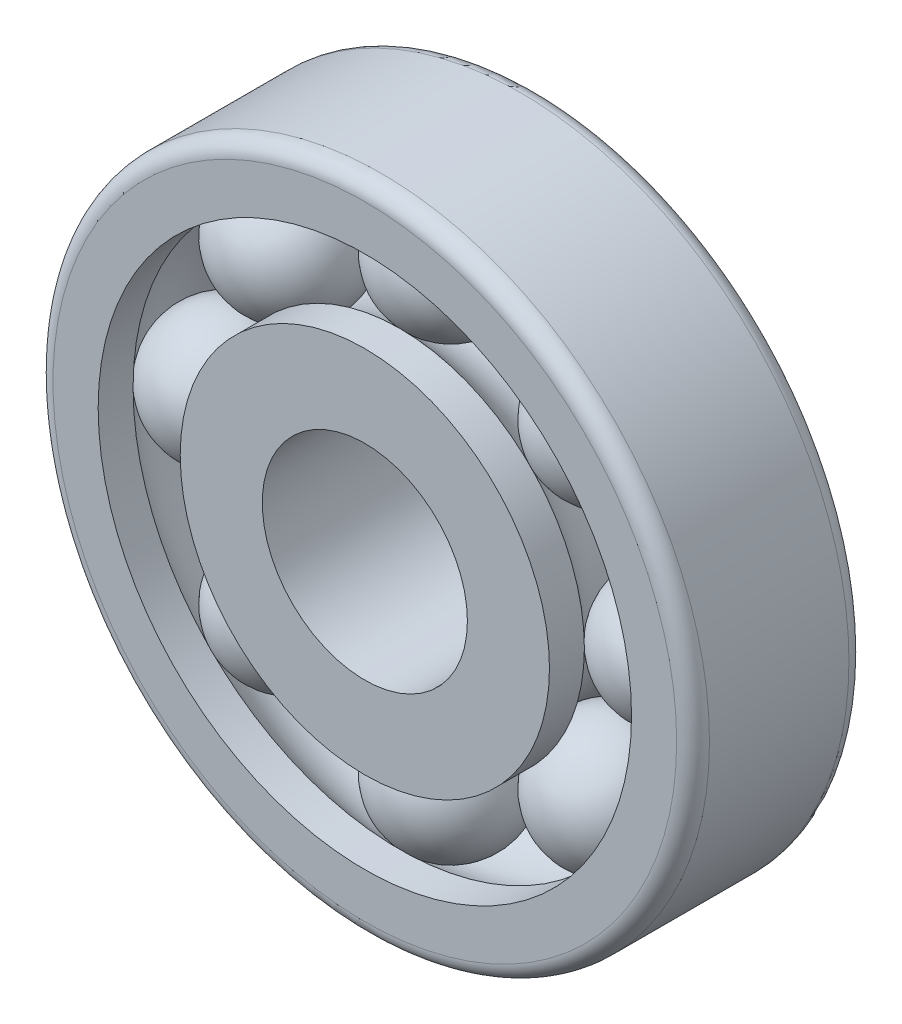
ISO-10303-21;
HEADER;
FILE_DESCRIPTION(('STEP AP214'),'2;1');
FILE_NAME('part.step','',(''),(''),'','','');
FILE_SCHEMA(('AUTOMOTIVE_DESIGN { 1 0 10303 214 1 1 1 1 }'));
ENDSEC;
DATA;
#1=APPLICATION_CONTEXT('core data for automotive mechanical design processes');
#2=APPLICATION_PROTOCOL_DEFINITION('international standard','automotive_design',2000,#1);
#3=PRODUCT_CONTEXT('',#1,'mechanical');
#4=PRODUCT('Part','Part','',(#3));
#5=PRODUCT_RELATED_PRODUCT_CATEGORY('part','',(#4));
#6=PRODUCT_DEFINITION_FORMATION('','',#4);
#7=PRODUCT_DEFINITION_CONTEXT('part definition',#1,'design');
#8=PRODUCT_DEFINITION('design','',#6,#7);
#9=PRODUCT_DEFINITION_SHAPE('','',#8);
#10=(LENGTH_UNIT() NAMED_UNIT(*) SI_UNIT(.MILLI.,.METRE.));
#11=(NAMED_UNIT(*) PLANE_ANGLE_UNIT() SI_UNIT($,.RADIAN.));
#12=(NAMED_UNIT(*) SI_UNIT($,.STERADIAN.) SOLID_ANGLE_UNIT());
#13=UNCERTAINTY_MEASURE_WITH_UNIT(LENGTH_MEASURE(1.E-05),#10,'distance_accuracy_value','');
#14=(GEOMETRIC_REPRESENTATION_CONTEXT(3) GLOBAL_UNCERTAINTY_ASSIGNED_CONTEXT((#13)) GLOBAL_UNIT_ASSIGNED_CONTEXT((#10,
#11,#12)) REPRESENTATION_CONTEXT('',''));
#15=CARTESIAN_POINT('',(0.,0.,0.));
#16=DIRECTION('',(0.,0.,1.));
#17=DIRECTION('',(1.,0.,0.));
#18=AXIS2_PLACEMENT_3D('',#15,#16,#17);
#19=CARTESIAN_POINT('',(19.4454364826303,-19.4454364826298,10.5));
#20=DIRECTION('',(0.,0.,-1.));
#21=DIRECTION('',(0.707106781186556,-0.707106781186539,0.));
#22=AXIS2_PLACEMENT_3D('',#19,#20,#21);
#23=SPHERICAL_SURFACE('',#22,8.);
#24=CARTESIAN_POINT('',(19.4454364826303,-19.4454364826298,2.50000000000001));
#25=VERTEX_POINT('',#24);
#26=VERTEX_LOOP('',#25);
#27=FACE_BOUND('',#26,.T.);
#28=ADVANCED_FACE('F52',(#27),#23,.T.);
#29=CLOSED_SHELL('',(#28));
#30=MANIFOLD_SOLID_BREP('B2',#29);
#31=CARTESIAN_POINT('',(2.88047210454559E-13,-27.5,10.5));
#32=DIRECTION('',(0.,0.,-1.));
#33=DIRECTION('',(0.,-1.,0.));
#34=AXIS2_PLACEMENT_3D('',#31,#32,#33);
#35=SPHERICAL_SURFACE('',#34,8.);
#36=CARTESIAN_POINT('',(2.88047210454559E-13,-27.5,2.50000000000001));
#37=VERTEX_POINT('',#36);
#38=VERTEX_LOOP('',#37);
#39=FACE_BOUND('',#38,.T.);
#40=ADVANCED_FACE('F73',(#39),#35,.T.);
#41=CLOSED_SHELL('',(#40));
#42=MANIFOLD_SOLID_BREP('B7',#41);
#43=CARTESIAN_POINT('',(-19.4454364826299,-19.4454364826302,10.5));
#44=DIRECTION('',(0.,0.,-1.));
#45=DIRECTION('',(-0.707106781186541,-0.707106781186554,0.));
#46=AXIS2_PLACEMENT_3D('',#43,#44,#45);
#47=SPHERICAL_SURFACE('',#46,8.);
#48=CARTESIAN_POINT('',(-19.4454364826299,-19.4454364826302,2.50000000000001));
#49=VERTEX_POINT('',#48);
#50=VERTEX_LOOP('',#49);
#51=FACE_BOUND('',#50,.T.);
#52=ADVANCED_FACE('F94',(#51),#47,.T.);
#53=CLOSED_SHELL('',(#52));
#54=MANIFOLD_SOLID_BREP('B48',#53);
#55=CARTESIAN_POINT('',(-27.5,0.,10.5));
#56=DIRECTION('',(0.,0.,-1.));
#57=DIRECTION('',(-1.,0.,0.));
#58=AXIS2_PLACEMENT_3D('',#55,#56,#57);
#59=SPHERICAL_SURFACE('',#58,8.);
#60=CARTESIAN_POINT('',(-27.5,0.,2.50000000000001));
#61=VERTEX_POINT('',#60);
#62=VERTEX_LOOP('',#61);
#63=FACE_BOUND('',#62,.T.);
#64=ADVANCED_FACE('F115',(#63),#59,.T.);
#65=CLOSED_SHELL('',(#64));
#66=MANIFOLD_SOLID_BREP('B69',#65);
#67=CARTESIAN_POINT('',(-19.4454364826302,19.44543648263,10.5));
#68=DIRECTION('',(0.,0.,-1.));
#69=DIRECTION('',(-0.707106781186551,0.707106781186544,0.));
#70=AXIS2_PLACEMENT_3D('',#67,#68,#69);
#71=SPHERICAL_SURFACE('',#70,8.);
#72=CARTESIAN_POINT('',(-19.4454364826302,19.44543648263,2.50000000000001));
#73=VERTEX_POINT('',#72);
#74=VERTEX_LOOP('',#73);
#75=FACE_BOUND('',#74,.T.);
#76=ADVANCED_FACE('F136',(#75),#71,.T.);
#77=CLOSED_SHELL('',(#76));
#78=MANIFOLD_SOLID_BREP('B90',#77);
#79=CARTESIAN_POINT('',(0.,27.5,10.5));
#80=DIRECTION('',(0.,0.,-1.));
#81=DIRECTION('',(0.,1.,0.));
#82=AXIS2_PLACEMENT_3D('',#79,#80,#81);
#83=SPHERICAL_SURFACE('',#82,8.);
#84=CARTESIAN_POINT('',(0.,27.5,2.50000000000001));
#85=VERTEX_POINT('',#84);
#86=VERTEX_LOOP('',#85);
#87=FACE_BOUND('',#86,.T.);
#88=ADVANCED_FACE('F157',(#87),#83,.T.);
#89=CLOSED_SHELL('',(#88));
#90=MANIFOLD_SOLID_BREP('B111',#89);
#91=CARTESIAN_POINT('',(19.44543648263,19.4454364826301,10.5));
#92=DIRECTION('',(0.,0.,-1.));
#93=DIRECTION('',(0.707106781186546,0.707106781186549,0.));
#94=AXIS2_PLACEMENT_3D('',#91,#92,#93);
#95=SPHERICAL_SURFACE('',#94,8.);
#96=CARTESIAN_POINT('',(19.44543648263,19.4454364826301,2.50000000000001));
#97=VERTEX_POINT('',#96);
#98=VERTEX_LOOP('',#97);
#99=FACE_BOUND('',#98,.T.);
#100=ADVANCED_FACE('F178',(#99),#95,.T.);
#101=CLOSED_SHELL('',(#100));
#102=MANIFOLD_SOLID_BREP('B132',#101);
#103=CARTESIAN_POINT('',(27.5,0.,10.5));
#104=DIRECTION('',(0.,0.,-1.));
#105=DIRECTION('',(1.,0.,0.));
#106=AXIS2_PLACEMENT_3D('',#103,#104,#105);
#107=SPHERICAL_SURFACE('',#106,8.);
#108=CARTESIAN_POINT('',(27.5,0.,2.50000000000001));
#109=VERTEX_POINT('',#108);
#110=VERTEX_LOOP('',#109);
#111=FACE_BOUND('',#110,.T.);
#112=ADVANCED_FACE('F201',(#111),#107,.T.);
#113=CLOSED_SHELL('',(#112));
#114=MANIFOLD_SOLID_BREP('B153',#113);
#115=CARTESIAN_POINT('',(0.,0.,21.));
#116=DIRECTION('',(0.,0.,-1.));
#117=DIRECTION('',(-1.,0.,0.));
#118=AXIS2_PLACEMENT_3D('',#115,#116,#117);
#119=CYLINDRICAL_SURFACE('',#118,22.5);
#120=CARTESIAN_POINT('',(0.,0.,16.7449979983984));
#121=DIRECTION('',(0.,0.,-1.));
#122=DIRECTION('',(-1.,0.,0.));
#123=AXIS2_PLACEMENT_3D('',#120,#121,#122);
#124=CIRCLE('',#123,22.5);
#125=CARTESIAN_POINT('',(-22.5,0.,16.7449979983984));
#126=VERTEX_POINT('',#125);
#127=EDGE_CURVE('E227',#126,#126,#124,.F.);
#128=ORIENTED_EDGE('',*,*,#127,.T.);
#129=EDGE_LOOP('',(#128));
#130=FACE_BOUND('',#129,.T.);
#131=CARTESIAN_POINT('',(0.,0.,21.));
#132=DIRECTION('',(0.,0.,1.));
#133=DIRECTION('',(1.,0.,0.));
#134=AXIS2_PLACEMENT_3D('',#131,#132,#133);
#135=CIRCLE('',#134,22.5);
#136=CARTESIAN_POINT('',(22.5,0.,21.));
#137=VERTEX_POINT('',#136);
#138=EDGE_CURVE('E200',#137,#137,#135,.T.);
#139=ORIENTED_EDGE('',*,*,#138,.F.);
#140=EDGE_LOOP('',(#139));
#141=FACE_BOUND('',#140,.T.);
#142=ADVANCED_FACE('F223',(#130,#141),#119,.T.);
#143=CARTESIAN_POINT('',(0.,0.,21.));
#144=DIRECTION('',(0.,0.,-1.));
#145=DIRECTION('',(-1.,0.,0.));
#146=AXIS2_PLACEMENT_3D('',#143,#144,#145);
#147=CYLINDRICAL_SURFACE('',#146,12.5);
#148=CARTESIAN_POINT('',(0.,0.,21.));
#149=DIRECTION('',(0.,0.,1.));
#150=DIRECTION('',(1.,0.,0.));
#151=AXIS2_PLACEMENT_3D('',#148,#149,#150);
#152=CIRCLE('',#151,12.5);
#153=CARTESIAN_POINT('',(12.5,0.,21.));
#154=VERTEX_POINT('',#153);
#155=EDGE_CURVE('E231',#154,#154,#152,.T.);
#156=ORIENTED_EDGE('',*,*,#155,.T.);
#157=EDGE_LOOP('',(#156));
#158=FACE_BOUND('',#157,.T.);
#159=CARTESIAN_POINT('',(0.,0.,0.));
#160=DIRECTION('',(0.,0.,1.));
#161=DIRECTION('',(1.,0.,0.));
#162=AXIS2_PLACEMENT_3D('',#159,#160,#161);
#163=CIRCLE('',#162,12.5);
#164=CARTESIAN_POINT('',(12.5,0.,0.));
#165=VERTEX_POINT('',#164);
#166=EDGE_CURVE('E239',#165,#165,#163,.T.);
#167=ORIENTED_EDGE('',*,*,#166,.F.);
#168=EDGE_LOOP('',(#167));
#169=FACE_BOUND('',#168,.T.);
#170=ADVANCED_FACE('F225',(#158,#169),#147,.F.);
#171=CARTESIAN_POINT('',(0.,0.,4.25500200160161));
#172=DIRECTION('',(0.,0.,1.));
#173=DIRECTION('',(1.,0.,0.));
#174=AXIS2_PLACEMENT_3D('',#171,#172,#173);
#175=CIRCLE('',#174,22.5);
#176=CARTESIAN_POINT('',(22.5,0.,4.25500200160161));
#177=VERTEX_POINT('',#176);
#178=EDGE_CURVE('E243',#177,#177,#175,.F.);
#179=ORIENTED_EDGE('',*,*,#178,.T.);
#180=EDGE_LOOP('',(#179));
#181=FACE_BOUND('',#180,.T.);
#182=CARTESIAN_POINT('',(0.,0.,0.));
#183=DIRECTION('',(0.,0.,1.));
#184=DIRECTION('',(1.,0.,0.));
#185=AXIS2_PLACEMENT_3D('',#182,#183,#184);
#186=CIRCLE('',#185,22.5);
#187=CARTESIAN_POINT('',(22.5,0.,0.));
#188=VERTEX_POINT('',#187);
#189=EDGE_CURVE('E236',#188,#188,#186,.T.);
#190=ORIENTED_EDGE('',*,*,#189,.T.);
#191=EDGE_LOOP('',(#190));
#192=FACE_BOUND('',#191,.T.);
#193=ADVANCED_FACE('F265',(#181,#192),#119,.T.);
#194=CARTESIAN_POINT('',(0.,0.,21.));
#195=DIRECTION('',(0.,0.,1.));
#196=DIRECTION('',(1.,0.,0.));
#197=AXIS2_PLACEMENT_3D('',#194,#195,#196);
#198=PLANE('',#197);
#199=ORIENTED_EDGE('',*,*,#155,.F.);
#200=EDGE_LOOP('',(#199));
#201=FACE_BOUND('',#200,.T.);
#202=ORIENTED_EDGE('',*,*,#138,.T.);
#203=EDGE_LOOP('',(#202));
#204=FACE_BOUND('',#203,.T.);
#205=ADVANCED_FACE('F260',(#201,#204),#198,.T.);
#206=CARTESIAN_POINT('',(0.,0.,0.));
#207=DIRECTION('',(0.,0.,1.));
#208=DIRECTION('',(1.,0.,0.));
#209=AXIS2_PLACEMENT_3D('',#206,#207,#208);
#210=PLANE('',#209);
#211=ORIENTED_EDGE('',*,*,#166,.T.);
#212=EDGE_LOOP('',(#211));
#213=FACE_BOUND('',#212,.T.);
#214=ORIENTED_EDGE('',*,*,#189,.F.);
#215=EDGE_LOOP('',(#214));
#216=FACE_BOUND('',#215,.T.);
#217=ADVANCED_FACE('F254',(#213,#216),#210,.F.);
#218=CARTESIAN_POINT('',(0.,0.,10.5));
#219=DIRECTION('',(0.,0.,1.));
#220=DIRECTION('',(1.,0.,0.));
#221=AXIS2_PLACEMENT_3D('',#218,#219,#220);
#222=TOROIDAL_SURFACE('',#221,27.5,8.);
#223=ORIENTED_EDGE('',*,*,#178,.F.);
#224=EDGE_LOOP('',(#223));
#225=FACE_BOUND('',#224,.T.);
#226=ORIENTED_EDGE('',*,*,#127,.F.);
#227=EDGE_LOOP('',(#226));
#228=FACE_BOUND('',#227,.T.);
#229=ADVANCED_FACE('F252',(#225,#228),#222,.F.);
#230=CLOSED_SHELL('',(#142,#170,#193,#205,#217,#229));
#231=MANIFOLD_SOLID_BREP('B174',#230);
#232=CARTESIAN_POINT('',(0.,0.,21.));
#233=DIRECTION('',(0.,0.,-1.));
#234=DIRECTION('',(-1.,0.,0.));
#235=AXIS2_PLACEMENT_3D('',#232,#233,#234);
#236=CYLINDRICAL_SURFACE('',#235,32.5);
#237=CARTESIAN_POINT('',(0.,0.,16.7449979983984));
#238=DIRECTION('',(0.,0.,-1.));
#239=DIRECTION('',(-1.,0.,0.));
#240=AXIS2_PLACEMENT_3D('',#237,#238,#239);
#241=CIRCLE('',#240,32.5);
#242=CARTESIAN_POINT('',(-32.5,0.,16.7449979983984));
#243=VERTEX_POINT('',#242);
#244=EDGE_CURVE('E345',#243,#243,#241,.F.);
#245=ORIENTED_EDGE('',*,*,#244,.F.);
#246=EDGE_LOOP('',(#245));
#247=FACE_BOUND('',#246,.T.);
#248=CARTESIAN_POINT('',(0.,0.,21.));
#249=DIRECTION('',(0.,0.,1.));
#250=DIRECTION('',(1.,0.,0.));
#251=AXIS2_PLACEMENT_3D('',#248,#249,#250);
#252=CIRCLE('',#251,32.5);
#253=CARTESIAN_POINT('',(32.5,0.,21.));
#254=VERTEX_POINT('',#253);
#255=EDGE_CURVE('E344',#254,#254,#252,.T.);
#256=ORIENTED_EDGE('',*,*,#255,.T.);
#257=EDGE_LOOP('',(#256));
#258=FACE_BOUND('',#257,.T.);
#259=ADVANCED_FACE('F320',(#247,#258),#236,.F.);
#260=CARTESIAN_POINT('',(0.,0.,4.25500200160161));
#261=DIRECTION('',(0.,0.,1.));
#262=DIRECTION('',(1.,0.,0.));
#263=AXIS2_PLACEMENT_3D('',#260,#261,#262);
#264=CIRCLE('',#263,32.5);
#265=CARTESIAN_POINT('',(32.5,0.,4.25500200160161));
#266=VERTEX_POINT('',#265);
#267=EDGE_CURVE('E350',#266,#266,#264,.F.);
#268=ORIENTED_EDGE('',*,*,#267,.F.);
#269=EDGE_LOOP('',(#268));
#270=FACE_BOUND('',#269,.T.);
#271=CARTESIAN_POINT('',(0.,0.,0.));
#272=DIRECTION('',(0.,0.,1.));
#273=DIRECTION('',(1.,0.,0.));
#274=AXIS2_PLACEMENT_3D('',#271,#272,#273);
#275=CIRCLE('',#274,32.5);
#276=CARTESIAN_POINT('',(32.5,0.,0.));
#277=VERTEX_POINT('',#276);
#278=EDGE_CURVE('E349',#277,#277,#275,.T.);
#279=ORIENTED_EDGE('',*,*,#278,.F.);
#280=EDGE_LOOP('',(#279));
#281=FACE_BOUND('',#280,.T.);
#282=ADVANCED_FACE('F374',(#270,#281),#236,.F.);
#283=CARTESIAN_POINT('',(0.,0.,21.));
#284=DIRECTION('',(0.,0.,-1.));
#285=DIRECTION('',(-1.,0.,0.));
#286=AXIS2_PLACEMENT_3D('',#283,#284,#285);
#287=CYLINDRICAL_SURFACE('',#286,40.);
#288=CARTESIAN_POINT('',(0.,0.,19.));
#289=DIRECTION('',(0.,0.,1.));
#290=DIRECTION('',(1.,0.,0.));
#291=AXIS2_PLACEMENT_3D('',#288,#289,#290);
#292=CIRCLE('',#291,40.);
#293=CARTESIAN_POINT('',(40.,0.,19.));
#294=VERTEX_POINT('',#293);
#295=EDGE_CURVE('E328',#294,#294,#292,.F.);
#296=ORIENTED_EDGE('',*,*,#295,.T.);
#297=EDGE_LOOP('',(#296));
#298=FACE_BOUND('',#297,.T.);
#299=CARTESIAN_POINT('',(0.,0.,2.));
#300=DIRECTION('',(0.,0.,1.));
#301=DIRECTION('',(1.,0.,0.));
#302=AXIS2_PLACEMENT_3D('',#299,#300,#301);
#303=CIRCLE('',#302,40.);
#304=CARTESIAN_POINT('',(40.,0.,2.));
#305=VERTEX_POINT('',#304);
#306=EDGE_CURVE('E333',#305,#305,#303,.T.);
#307=ORIENTED_EDGE('',*,*,#306,.T.);
#308=EDGE_LOOP('',(#307));
#309=FACE_BOUND('',#308,.T.);
#310=ADVANCED_FACE('F365',(#298,#309),#287,.T.);
#311=CARTESIAN_POINT('',(0.,0.,21.));
#312=DIRECTION('',(0.,0.,1.));
#313=DIRECTION('',(1.,0.,0.));
#314=AXIS2_PLACEMENT_3D('',#311,#312,#313);
#315=PLANE('',#314);
#316=CARTESIAN_POINT('',(0.,0.,21.));
#317=DIRECTION('',(0.,0.,1.));
#318=DIRECTION('',(1.,0.,0.));
#319=AXIS2_PLACEMENT_3D('',#316,#317,#318);
#320=CIRCLE('',#319,38.);
#321=CARTESIAN_POINT('',(38.,0.,21.));
#322=VERTEX_POINT('',#321);
#323=EDGE_CURVE('E338',#322,#322,#320,.T.);
#324=ORIENTED_EDGE('',*,*,#323,.T.);
#325=EDGE_LOOP('',(#324));
#326=FACE_BOUND('',#325,.T.);
#327=ORIENTED_EDGE('',*,*,#255,.F.);
#328=EDGE_LOOP('',(#327));
#329=FACE_BOUND('',#328,.T.);
#330=ADVANCED_FACE('F362',(#326,#329),#315,.T.);
#331=CARTESIAN_POINT('',(0.,0.,0.));
#332=DIRECTION('',(0.,0.,1.));
#333=DIRECTION('',(1.,0.,0.));
#334=AXIS2_PLACEMENT_3D('',#331,#332,#333);
#335=PLANE('',#334);
#336=CARTESIAN_POINT('',(0.,0.,0.));
#337=DIRECTION('',(0.,0.,1.));
#338=DIRECTION('',(1.,0.,0.));
#339=AXIS2_PLACEMENT_3D('',#336,#337,#338);
#340=CIRCLE('',#339,38.);
#341=CARTESIAN_POINT('',(38.,0.,0.));
#342=VERTEX_POINT('',#341);
#343=EDGE_CURVE('E222',#342,#342,#340,.F.);
#344=ORIENTED_EDGE('',*,*,#343,.T.);
#345=EDGE_LOOP('',(#344));
#346=FACE_BOUND('',#345,.T.);
#347=ORIENTED_EDGE('',*,*,#278,.T.);
#348=EDGE_LOOP('',(#347));
#349=FACE_BOUND('',#348,.T.);
#350=ADVANCED_FACE('F364',(#346,#349),#335,.F.);
#351=CARTESIAN_POINT('',(0.,0.,10.5));
#352=DIRECTION('',(0.,0.,1.));
#353=DIRECTION('',(1.,0.,0.));
#354=AXIS2_PLACEMENT_3D('',#351,#352,#353);
#355=TOROIDAL_SURFACE('',#354,27.5,8.);
#356=ORIENTED_EDGE('',*,*,#244,.T.);
#357=EDGE_LOOP('',(#356));
#358=FACE_BOUND('',#357,.T.);
#359=ORIENTED_EDGE('',*,*,#267,.T.);
#360=EDGE_LOOP('',(#359));
#361=FACE_BOUND('',#360,.T.);
#362=ADVANCED_FACE('F372',(#358,#361),#355,.F.);
#363=CARTESIAN_POINT('',(0.,0.,19.));
#364=DIRECTION('',(0.,0.,1.));
#365=DIRECTION('',(1.,0.,0.));
#366=AXIS2_PLACEMENT_3D('',#363,#364,#365);
#367=TOROIDAL_SURFACE('',#366,38.,2.);
#368=ORIENTED_EDGE('',*,*,#295,.F.);
#369=EDGE_LOOP('',(#368));
#370=FACE_BOUND('',#369,.T.);
#371=ORIENTED_EDGE('',*,*,#323,.F.);
#372=EDGE_LOOP('',(#371));
#373=FACE_BOUND('',#372,.T.);
#374=ADVANCED_FACE('F385',(#370,#373),#367,.T.);
#375=CARTESIAN_POINT('',(0.,0.,2.));
#376=DIRECTION('',(0.,0.,1.));
#377=DIRECTION('',(1.,0.,0.));
#378=AXIS2_PLACEMENT_3D('',#375,#376,#377);
#379=TOROIDAL_SURFACE('',#378,38.,2.);
#380=ORIENTED_EDGE('',*,*,#343,.F.);
#381=EDGE_LOOP('',(#380));
#382=FACE_BOUND('',#381,.T.);
#383=ORIENTED_EDGE('',*,*,#306,.F.);
#384=EDGE_LOOP('',(#383));
#385=FACE_BOUND('',#384,.T.);
#386=ADVANCED_FACE('F322',(#382,#385),#379,.T.);
#387=CLOSED_SHELL('',(#259,#282,#310,#330,#350,#362,#374,#386));
#388=MANIFOLD_SOLID_BREP('B195',#387);
#389=ADVANCED_BREP_SHAPE_REPRESENTATION('',(#18,#30,#42,#54,#66,#78,#90,#102,#114,#231,#388),#14);
#390=SHAPE_DEFINITION_REPRESENTATION(#9,#389);
ENDSEC;
END-ISO-10303-21;
